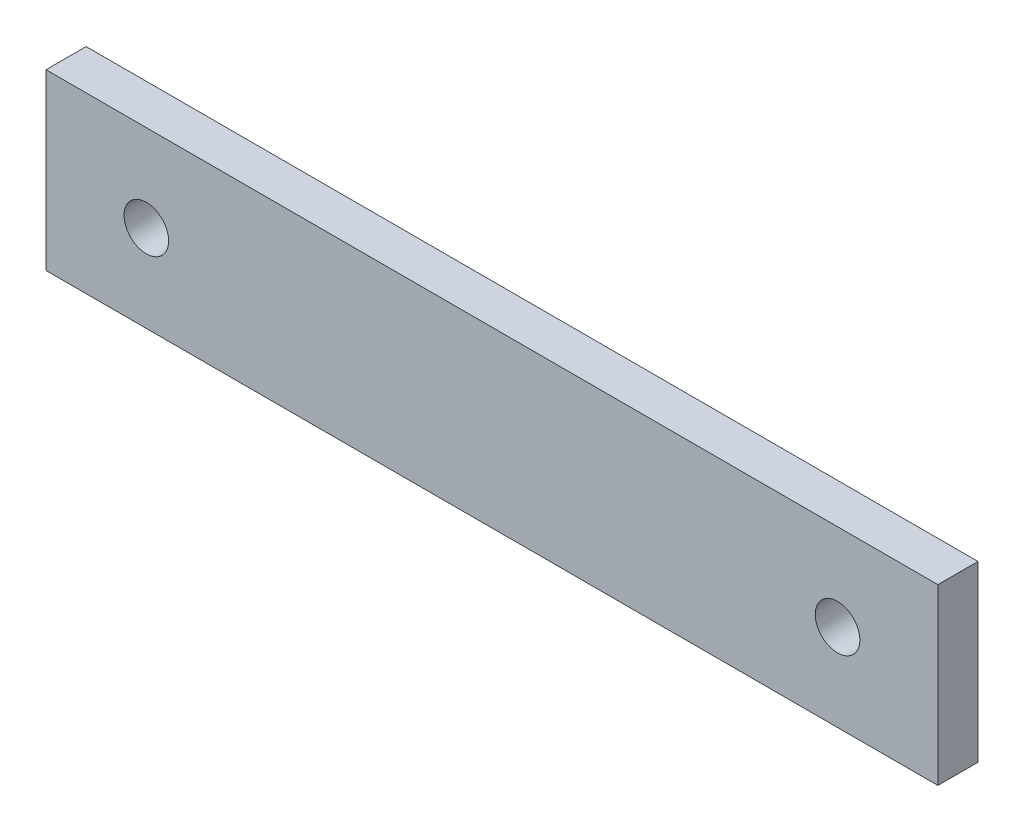
ISO-10303-21;
HEADER;
FILE_DESCRIPTION(('STEP AP214'),'2;1');
FILE_NAME('part.step','',(''),(''),'','','');
FILE_SCHEMA(('AUTOMOTIVE_DESIGN { 1 0 10303 214 1 1 1 1 }'));
ENDSEC;
DATA;
#1=APPLICATION_CONTEXT('core data for automotive mechanical design processes');
#2=APPLICATION_PROTOCOL_DEFINITION('international standard','automotive_design',2000,#1);
#3=PRODUCT_CONTEXT('',#1,'mechanical');
#4=PRODUCT('Part','Part','',(#3));
#5=PRODUCT_RELATED_PRODUCT_CATEGORY('part','',(#4));
#6=PRODUCT_DEFINITION_FORMATION('','',#4);
#7=PRODUCT_DEFINITION_CONTEXT('part definition',#1,'design');
#8=PRODUCT_DEFINITION('design','',#6,#7);
#9=PRODUCT_DEFINITION_SHAPE('','',#8);
#10=(LENGTH_UNIT() NAMED_UNIT(*) SI_UNIT(.MILLI.,.METRE.));
#11=(NAMED_UNIT(*) PLANE_ANGLE_UNIT() SI_UNIT($,.RADIAN.));
#12=(NAMED_UNIT(*) SI_UNIT($,.STERADIAN.) SOLID_ANGLE_UNIT());
#13=UNCERTAINTY_MEASURE_WITH_UNIT(LENGTH_MEASURE(1.E-05),#10,'distance_accuracy_value','');
#14=(GEOMETRIC_REPRESENTATION_CONTEXT(3) GLOBAL_UNCERTAINTY_ASSIGNED_CONTEXT((#13)) GLOBAL_UNIT_ASSIGNED_CONTEXT((#10,
#11,#12)) REPRESENTATION_CONTEXT('',''));
#15=CARTESIAN_POINT('',(0.,0.,0.));
#16=DIRECTION('',(0.,0.,1.));
#17=DIRECTION('',(1.,0.,0.));
#18=AXIS2_PLACEMENT_3D('',#15,#16,#17);
#19=CARTESIAN_POINT('',(0.,0.,9.));
#20=DIRECTION('',(0.,0.,1.));
#21=DIRECTION('',(1.,0.,0.));
#22=AXIS2_PLACEMENT_3D('',#19,#20,#21);
#23=PLANE('',#22);
#24=CARTESIAN_POINT('',(-20.6052631578947,-1.36842105263157,9.));
#25=DIRECTION('',(0.,0.,1.));
#26=DIRECTION('',(1.,0.,0.));
#27=AXIS2_PLACEMENT_3D('',#24,#25,#26);
#28=CIRCLE('',#27,5.);
#29=CARTESIAN_POINT('',(-15.6052631578947,-1.36842105263157,9.));
#30=VERTEX_POINT('',#29);
#31=EDGE_CURVE('E100',#30,#30,#28,.T.);
#32=ORIENTED_EDGE('',*,*,#31,.F.);
#33=EDGE_LOOP('',(#32));
#34=FACE_BOUND('',#33,.T.);
#35=DIRECTION('',(0.,-1.,0.));
#36=VECTOR('',#35,1.);
#37=CARTESIAN_POINT('',(-43.1052631578947,18.1315789473684,9.));
#38=LINE('',#37,#36);
#39=CARTESIAN_POINT('',(-43.1052631578947,18.1315789473684,9.));
#40=VERTEX_POINT('',#39);
#41=CARTESIAN_POINT('',(-43.1052631578947,-20.8684210526316,9.));
#42=VERTEX_POINT('',#41);
#43=EDGE_CURVE('E85',#40,#42,#38,.T.);
#44=ORIENTED_EDGE('',*,*,#43,.T.);
#45=DIRECTION('',(1.,0.,0.));
#46=VECTOR('',#45,1.);
#47=CARTESIAN_POINT('',(-43.1052631578947,-20.8684210526316,9.));
#48=LINE('',#47,#46);
#49=CARTESIAN_POINT('',(156.894736842105,-20.8684210526316,9.));
#50=VERTEX_POINT('',#49);
#51=EDGE_CURVE('E80',#42,#50,#48,.T.);
#52=ORIENTED_EDGE('',*,*,#51,.T.);
#53=DIRECTION('',(0.,1.,0.));
#54=VECTOR('',#53,1.);
#55=CARTESIAN_POINT('',(156.894736842105,18.1315789473684,9.));
#56=LINE('',#55,#54);
#57=CARTESIAN_POINT('',(156.894736842105,18.1315789473684,9.));
#58=VERTEX_POINT('',#57);
#59=EDGE_CURVE('E83',#50,#58,#56,.T.);
#60=ORIENTED_EDGE('',*,*,#59,.T.);
#61=DIRECTION('',(-1.,0.,0.));
#62=VECTOR('',#61,1.);
#63=CARTESIAN_POINT('',(-43.1052631578947,18.1315789473684,9.));
#64=LINE('',#63,#62);
#65=EDGE_CURVE('E50',#58,#40,#64,.T.);
#66=ORIENTED_EDGE('',*,*,#65,.T.);
#67=EDGE_LOOP('',(#44,#52,#60,#66));
#68=FACE_BOUND('',#67,.T.);
#69=CARTESIAN_POINT('',(134.394736842105,-1.36842105263157,9.));
#70=DIRECTION('',(0.,0.,1.));
#71=DIRECTION('',(-1.,0.,0.));
#72=AXIS2_PLACEMENT_3D('',#69,#70,#71);
#73=CIRCLE('',#72,5.00000000000002);
#74=CARTESIAN_POINT('',(129.394736842105,-1.36842105263157,9.));
#75=VERTEX_POINT('',#74);
#76=EDGE_CURVE('E115',#75,#75,#73,.T.);
#77=ORIENTED_EDGE('',*,*,#76,.F.);
#78=EDGE_LOOP('',(#77));
#79=FACE_BOUND('',#78,.T.);
#80=ADVANCED_FACE('F33',(#34,#68,#79),#23,.T.);
#81=CARTESIAN_POINT('',(0.,0.,0.));
#82=DIRECTION('',(0.,0.,1.));
#83=DIRECTION('',(1.,0.,0.));
#84=AXIS2_PLACEMENT_3D('',#81,#82,#83);
#85=PLANE('',#84);
#86=DIRECTION('',(0.,-1.,0.));
#87=VECTOR('',#86,1.);
#88=CARTESIAN_POINT('',(-43.1052631578947,18.1315789473684,0.));
#89=LINE('',#88,#87);
#90=CARTESIAN_POINT('',(-43.1052631578947,18.1315789473684,0.));
#91=VERTEX_POINT('',#90);
#92=CARTESIAN_POINT('',(-43.1052631578947,-20.8684210526316,0.));
#93=VERTEX_POINT('',#92);
#94=EDGE_CURVE('E97',#91,#93,#89,.T.);
#95=ORIENTED_EDGE('',*,*,#94,.F.);
#96=DIRECTION('',(-1.,0.,0.));
#97=VECTOR('',#96,1.);
#98=CARTESIAN_POINT('',(-43.1052631578947,18.1315789473684,0.));
#99=LINE('',#98,#97);
#100=CARTESIAN_POINT('',(156.894736842105,18.1315789473684,0.));
#101=VERTEX_POINT('',#100);
#102=EDGE_CURVE('E73',#101,#91,#99,.T.);
#103=ORIENTED_EDGE('',*,*,#102,.F.);
#104=DIRECTION('',(0.,1.,0.));
#105=VECTOR('',#104,1.);
#106=CARTESIAN_POINT('',(156.894736842105,18.1315789473684,0.));
#107=LINE('',#106,#105);
#108=CARTESIAN_POINT('',(156.894736842105,-20.8684210526316,0.));
#109=VERTEX_POINT('',#108);
#110=EDGE_CURVE('E67',#109,#101,#107,.T.);
#111=ORIENTED_EDGE('',*,*,#110,.F.);
#112=DIRECTION('',(1.,0.,0.));
#113=VECTOR('',#112,1.);
#114=CARTESIAN_POINT('',(-43.1052631578947,-20.8684210526316,0.));
#115=LINE('',#114,#113);
#116=EDGE_CURVE('E89',#93,#109,#115,.T.);
#117=ORIENTED_EDGE('',*,*,#116,.F.);
#118=EDGE_LOOP('',(#95,#103,#111,#117));
#119=FACE_BOUND('',#118,.T.);
#120=CARTESIAN_POINT('',(-20.6052631578947,-1.36842105263157,0.));
#121=DIRECTION('',(0.,0.,1.));
#122=DIRECTION('',(1.,0.,0.));
#123=AXIS2_PLACEMENT_3D('',#120,#121,#122);
#124=CIRCLE('',#123,5.);
#125=CARTESIAN_POINT('',(-15.6052631578947,-1.36842105263157,0.));
#126=VERTEX_POINT('',#125);
#127=EDGE_CURVE('E112',#126,#126,#124,.T.);
#128=ORIENTED_EDGE('',*,*,#127,.T.);
#129=EDGE_LOOP('',(#128));
#130=FACE_BOUND('',#129,.T.);
#131=CARTESIAN_POINT('',(134.394736842105,-1.36842105263157,0.));
#132=DIRECTION('',(0.,0.,1.));
#133=DIRECTION('',(-1.,0.,0.));
#134=AXIS2_PLACEMENT_3D('',#131,#132,#133);
#135=CIRCLE('',#134,5.00000000000002);
#136=CARTESIAN_POINT('',(129.394736842105,-1.36842105263157,0.));
#137=VERTEX_POINT('',#136);
#138=EDGE_CURVE('E118',#137,#137,#135,.T.);
#139=ORIENTED_EDGE('',*,*,#138,.T.);
#140=EDGE_LOOP('',(#139));
#141=FACE_BOUND('',#140,.T.);
#142=ADVANCED_FACE('F108',(#119,#130,#141),#85,.F.);
#143=CARTESIAN_POINT('',(-43.1052631578947,18.1315789473684,9.));
#144=DIRECTION('',(1.,0.,0.));
#145=DIRECTION('',(0.,0.,-1.));
#146=AXIS2_PLACEMENT_3D('',#143,#144,#145);
#147=PLANE('',#146);
#148=ORIENTED_EDGE('',*,*,#94,.T.);
#149=DIRECTION('',(0.,0.,-1.));
#150=VECTOR('',#149,1.);
#151=CARTESIAN_POINT('',(-43.1052631578947,-20.8684210526316,9.));
#152=LINE('',#151,#150);
#153=EDGE_CURVE('E11',#42,#93,#152,.T.);
#154=ORIENTED_EDGE('',*,*,#153,.F.);
#155=ORIENTED_EDGE('',*,*,#43,.F.);
#156=DIRECTION('',(0.,0.,-1.));
#157=VECTOR('',#156,1.);
#158=CARTESIAN_POINT('',(-43.1052631578947,18.1315789473684,9.));
#159=LINE('',#158,#157);
#160=EDGE_CURVE('E93',#40,#91,#159,.T.);
#161=ORIENTED_EDGE('',*,*,#160,.T.);
#162=EDGE_LOOP('',(#148,#154,#155,#161));
#163=FACE_BOUND('',#162,.T.);
#164=ADVANCED_FACE('F35',(#163),#147,.F.);
#165=CARTESIAN_POINT('',(-43.1052631578947,-20.8684210526316,9.));
#166=DIRECTION('',(0.,1.,0.));
#167=DIRECTION('',(-1.,0.,0.));
#168=AXIS2_PLACEMENT_3D('',#165,#166,#167);
#169=PLANE('',#168);
#170=ORIENTED_EDGE('',*,*,#116,.T.);
#171=DIRECTION('',(0.,0.,-1.));
#172=VECTOR('',#171,1.);
#173=CARTESIAN_POINT('',(156.894736842105,-20.8684210526316,9.));
#174=LINE('',#173,#172);
#175=EDGE_CURVE('E42',#50,#109,#174,.T.);
#176=ORIENTED_EDGE('',*,*,#175,.F.);
#177=ORIENTED_EDGE('',*,*,#51,.F.);
#178=ORIENTED_EDGE('',*,*,#153,.T.);
#179=EDGE_LOOP('',(#170,#176,#177,#178));
#180=FACE_BOUND('',#179,.T.);
#181=ADVANCED_FACE('F88',(#180),#169,.F.);
#182=CARTESIAN_POINT('',(156.894736842105,18.1315789473684,9.));
#183=DIRECTION('',(-1.,0.,0.));
#184=DIRECTION('',(0.,0.,1.));
#185=AXIS2_PLACEMENT_3D('',#182,#183,#184);
#186=PLANE('',#185);
#187=ORIENTED_EDGE('',*,*,#110,.T.);
#188=DIRECTION('',(0.,0.,-1.));
#189=VECTOR('',#188,1.);
#190=CARTESIAN_POINT('',(156.894736842105,18.1315789473684,9.));
#191=LINE('',#190,#189);
#192=EDGE_CURVE('E90',#58,#101,#191,.T.);
#193=ORIENTED_EDGE('',*,*,#192,.F.);
#194=ORIENTED_EDGE('',*,*,#59,.F.);
#195=ORIENTED_EDGE('',*,*,#175,.T.);
#196=EDGE_LOOP('',(#187,#193,#194,#195));
#197=FACE_BOUND('',#196,.T.);
#198=ADVANCED_FACE('F91',(#197),#186,.F.);
#199=CARTESIAN_POINT('',(-43.1052631578947,18.1315789473684,9.));
#200=DIRECTION('',(0.,-1.,0.));
#201=DIRECTION('',(0.,0.,-1.));
#202=AXIS2_PLACEMENT_3D('',#199,#200,#201);
#203=PLANE('',#202);
#204=ORIENTED_EDGE('',*,*,#102,.T.);
#205=ORIENTED_EDGE('',*,*,#160,.F.);
#206=ORIENTED_EDGE('',*,*,#65,.F.);
#207=ORIENTED_EDGE('',*,*,#192,.T.);
#208=EDGE_LOOP('',(#204,#205,#206,#207));
#209=FACE_BOUND('',#208,.T.);
#210=ADVANCED_FACE('F105',(#209),#203,.F.);
#211=CARTESIAN_POINT('',(-20.6052631578947,-1.36842105263157,9.));
#212=DIRECTION('',(0.,0.,-1.));
#213=DIRECTION('',(-1.,0.,0.));
#214=AXIS2_PLACEMENT_3D('',#211,#212,#213);
#215=CYLINDRICAL_SURFACE('',#214,5.);
#216=ORIENTED_EDGE('',*,*,#31,.T.);
#217=EDGE_LOOP('',(#216));
#218=FACE_BOUND('',#217,.T.);
#219=ORIENTED_EDGE('',*,*,#127,.F.);
#220=EDGE_LOOP('',(#219));
#221=FACE_BOUND('',#220,.T.);
#222=ADVANCED_FACE('F135',(#218,#221),#215,.F.);
#223=CARTESIAN_POINT('',(134.394736842105,-1.36842105263157,9.));
#224=DIRECTION('',(0.,0.,-1.));
#225=DIRECTION('',(-1.,0.,0.));
#226=AXIS2_PLACEMENT_3D('',#223,#224,#225);
#227=CYLINDRICAL_SURFACE('',#226,5.00000000000002);
#228=ORIENTED_EDGE('',*,*,#76,.T.);
#229=EDGE_LOOP('',(#228));
#230=FACE_BOUND('',#229,.T.);
#231=ORIENTED_EDGE('',*,*,#138,.F.);
#232=EDGE_LOOP('',(#231));
#233=FACE_BOUND('',#232,.T.);
#234=ADVANCED_FACE('F124',(#230,#233),#227,.F.);
#235=CLOSED_SHELL('',(#80,#142,#164,#181,#198,#210,#222,#234));
#236=MANIFOLD_SOLID_BREP('B2',#235);
#237=ADVANCED_BREP_SHAPE_REPRESENTATION('',(#18,#236),#14);
#238=SHAPE_DEFINITION_REPRESENTATION(#9,#237);
ENDSEC;
END-ISO-10303-21;
